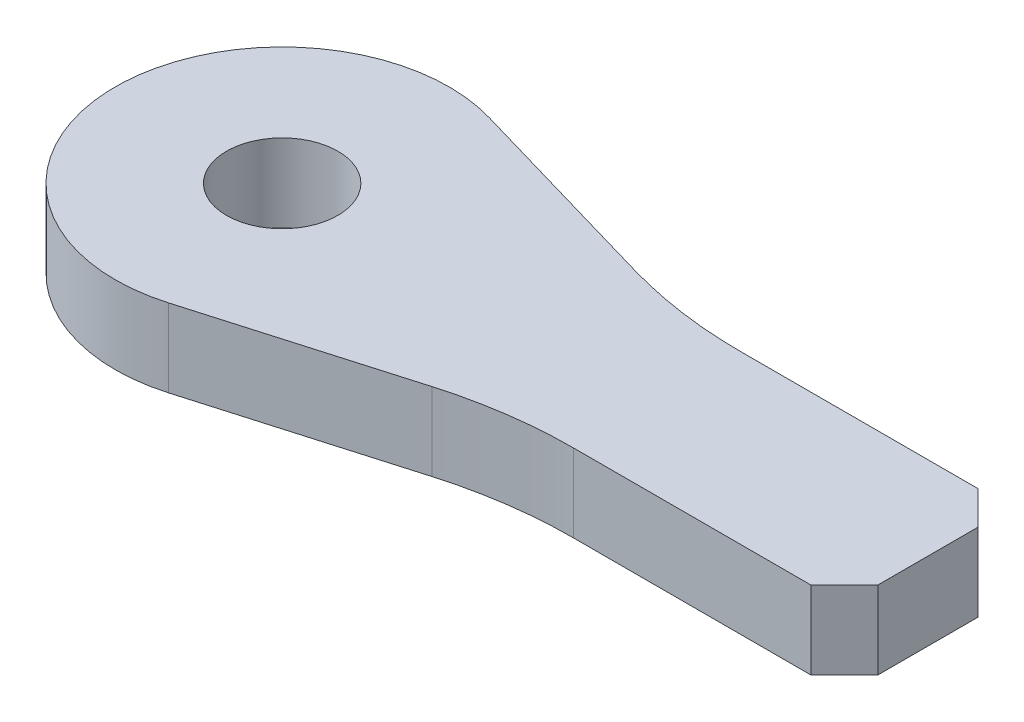
ISO-10303-21;
HEADER;
FILE_DESCRIPTION(('STEP AP214'),'2;1');
FILE_NAME('part.step','',(''),(''),'','','');
FILE_SCHEMA(('AUTOMOTIVE_DESIGN { 1 0 10303 214 1 1 1 1 }'));
ENDSEC;
DATA;
#1=APPLICATION_CONTEXT('core data for automotive mechanical design processes');
#2=APPLICATION_PROTOCOL_DEFINITION('international standard','automotive_design',2000,#1);
#3=PRODUCT_CONTEXT('',#1,'mechanical');
#4=PRODUCT('Part','Part','',(#3));
#5=PRODUCT_RELATED_PRODUCT_CATEGORY('part','',(#4));
#6=PRODUCT_DEFINITION_FORMATION('','',#4);
#7=PRODUCT_DEFINITION_CONTEXT('part definition',#1,'design');
#8=PRODUCT_DEFINITION('design','',#6,#7);
#9=PRODUCT_DEFINITION_SHAPE('','',#8);
#10=(LENGTH_UNIT() NAMED_UNIT(*) SI_UNIT(.MILLI.,.METRE.));
#11=(NAMED_UNIT(*) PLANE_ANGLE_UNIT() SI_UNIT($,.RADIAN.));
#12=(NAMED_UNIT(*) SI_UNIT($,.STERADIAN.) SOLID_ANGLE_UNIT());
#13=UNCERTAINTY_MEASURE_WITH_UNIT(LENGTH_MEASURE(1.E-05),#10,'distance_accuracy_value','');
#14=(GEOMETRIC_REPRESENTATION_CONTEXT(3) GLOBAL_UNCERTAINTY_ASSIGNED_CONTEXT((#13)) GLOBAL_UNIT_ASSIGNED_CONTEXT((#10,
#11,#12)) REPRESENTATION_CONTEXT('',''));
#15=CARTESIAN_POINT('',(0.,0.,0.));
#16=DIRECTION('',(0.,0.,1.));
#17=DIRECTION('',(1.,0.,0.));
#18=AXIS2_PLACEMENT_3D('',#15,#16,#17);
#19=CARTESIAN_POINT('',(13.1836541139506,7.,47.5));
#20=DIRECTION('',(0.,1.,0.));
#21=DIRECTION('',(0.,0.,1.));
#22=AXIS2_PLACEMENT_3D('',#19,#20,#21);
#23=PLANE('',#22);
#24=CARTESIAN_POINT('',(13.1836541139506,7.,47.5));
#25=DIRECTION('',(0.,-1.,0.));
#26=DIRECTION('',(0.,0.,1.));
#27=AXIS2_PLACEMENT_3D('',#24,#25,#26);
#28=CIRCLE('',#27,40.);
#29=CARTESIAN_POINT('',(2.0413092992037,7.,9.08323084863482));
#30=VERTEX_POINT('',#29);
#31=CARTESIAN_POINT('',(13.1836541139507,7.,7.5));
#32=VERTEX_POINT('',#31);
#33=EDGE_CURVE('E161',#30,#32,#28,.T.);
#34=ORIENTED_EDGE('',*,*,#33,.T.);
#35=DIRECTION('',(1.,0.,0.));
#36=VECTOR('',#35,1.);
#37=CARTESIAN_POINT('',(13.1836541139507,7.,7.5));
#38=LINE('',#37,#36);
#39=CARTESIAN_POINT('',(34.5,7.,7.5));
#40=VERTEX_POINT('',#39);
#41=EDGE_CURVE('E99',#32,#40,#38,.T.);
#42=ORIENTED_EDGE('',*,*,#41,.T.);
#43=DIRECTION('',(0.707106781186548,0.,-0.707106781186547));
#44=VECTOR('',#43,1.);
#45=CARTESIAN_POINT('',(34.5,7.,7.5));
#46=LINE('',#45,#44);
#47=CARTESIAN_POINT('',(37.5,7.,4.5));
#48=VERTEX_POINT('',#47);
#49=EDGE_CURVE('E182',#40,#48,#46,.T.);
#50=ORIENTED_EDGE('',*,*,#49,.T.);
#51=DIRECTION('',(0.,0.,-1.));
#52=VECTOR('',#51,1.);
#53=CARTESIAN_POINT('',(37.5,7.,4.5));
#54=LINE('',#53,#52);
#55=CARTESIAN_POINT('',(37.5,7.,-4.49999999999999));
#56=VERTEX_POINT('',#55);
#57=EDGE_CURVE('E201',#48,#56,#54,.T.);
#58=ORIENTED_EDGE('',*,*,#57,.T.);
#59=DIRECTION('',(-0.707106781186547,0.,-0.707106781186548));
#60=VECTOR('',#59,1.);
#61=CARTESIAN_POINT('',(37.5,7.,-4.49999999999999));
#62=LINE('',#61,#60);
#63=CARTESIAN_POINT('',(34.5,7.,-7.5));
#64=VERTEX_POINT('',#63);
#65=EDGE_CURVE('E198',#56,#64,#62,.T.);
#66=ORIENTED_EDGE('',*,*,#65,.T.);
#67=DIRECTION('',(-1.,0.,0.));
#68=VECTOR('',#67,1.);
#69=CARTESIAN_POINT('',(34.5,7.,-7.5));
#70=LINE('',#69,#68);
#71=CARTESIAN_POINT('',(13.1836541139507,7.,-7.5));
#72=VERTEX_POINT('',#71);
#73=EDGE_CURVE('E200',#64,#72,#70,.T.);
#74=ORIENTED_EDGE('',*,*,#73,.T.);
#75=CARTESIAN_POINT('',(13.1836541139506,7.,-47.5));
#76=DIRECTION('',(0.,-1.,0.));
#77=DIRECTION('',(0.,0.,-1.));
#78=AXIS2_PLACEMENT_3D('',#75,#76,#77);
#79=CIRCLE('',#78,40.);
#80=CARTESIAN_POINT('',(2.04130929920372,7.,-9.0832308486348));
#81=VERTEX_POINT('',#80);
#82=EDGE_CURVE('E124',#72,#81,#79,.T.);
#83=ORIENTED_EDGE('',*,*,#82,.T.);
#84=DIRECTION('',(-0.960419228784131,0.,-0.278558620368668));
#85=VECTOR('',#84,1.);
#86=CARTESIAN_POINT('',(2.0413092992037,7.,-9.08323084863481));
#87=LINE('',#86,#85);
#88=CARTESIAN_POINT('',(-16.31162069447,7.,-14.406288431762));
#89=VERTEX_POINT('',#88);
#90=EDGE_CURVE('E118',#81,#89,#87,.T.);
#91=ORIENTED_EDGE('',*,*,#90,.T.);
#92=CARTESIAN_POINT('',(-20.49,7.,0.));
#93=DIRECTION('',(0.,1.,0.));
#94=DIRECTION('',(0.,0.,1.));
#95=AXIS2_PLACEMENT_3D('',#92,#93,#94);
#96=CIRCLE('',#95,15.);
#97=CARTESIAN_POINT('',(-16.31162069447,7.,14.406288431762));
#98=VERTEX_POINT('',#97);
#99=EDGE_CURVE('E122',#89,#98,#96,.T.);
#100=ORIENTED_EDGE('',*,*,#99,.T.);
#101=DIRECTION('',(0.960419228784131,0.,-0.278558620368668));
#102=VECTOR('',#101,1.);
#103=CARTESIAN_POINT('',(2.0413092992037,7.,9.08323084863482));
#104=LINE('',#103,#102);
#105=EDGE_CURVE('E50',#98,#30,#104,.T.);
#106=ORIENTED_EDGE('',*,*,#105,.T.);
#107=EDGE_LOOP('',(#34,#42,#50,#58,#66,#74,#83,#91,#100,#106));
#108=FACE_BOUND('',#107,.T.);
#109=CARTESIAN_POINT('',(-20.49,7.,0.));
#110=DIRECTION('',(0.,1.,0.));
#111=DIRECTION('',(0.,0.,1.));
#112=AXIS2_PLACEMENT_3D('',#109,#110,#111);
#113=CIRCLE('',#112,5.);
#114=CARTESIAN_POINT('',(-20.49,7.,5.));
#115=VERTEX_POINT('',#114);
#116=EDGE_CURVE('E146',#115,#115,#113,.T.);
#117=ORIENTED_EDGE('',*,*,#116,.F.);
#118=EDGE_LOOP('',(#117));
#119=FACE_BOUND('',#118,.T.);
#120=ADVANCED_FACE('F33',(#108,#119),#23,.T.);
#121=CARTESIAN_POINT('',(13.1836541139506,0.,47.5));
#122=DIRECTION('',(0.,1.,0.));
#123=DIRECTION('',(0.,0.,1.));
#124=AXIS2_PLACEMENT_3D('',#121,#122,#123);
#125=PLANE('',#124);
#126=CARTESIAN_POINT('',(13.1836541139506,0.,47.5));
#127=DIRECTION('',(0.,-1.,0.));
#128=DIRECTION('',(0.,0.,1.));
#129=AXIS2_PLACEMENT_3D('',#126,#127,#128);
#130=CIRCLE('',#129,40.);
#131=CARTESIAN_POINT('',(2.0413092992037,0.,9.08323084863482));
#132=VERTEX_POINT('',#131);
#133=CARTESIAN_POINT('',(13.1836541139507,0.,7.5));
#134=VERTEX_POINT('',#133);
#135=EDGE_CURVE('E142',#132,#134,#130,.T.);
#136=ORIENTED_EDGE('',*,*,#135,.F.);
#137=DIRECTION('',(0.960419228784131,0.,-0.278558620368668));
#138=VECTOR('',#137,1.);
#139=CARTESIAN_POINT('',(2.0413092992037,0.,9.08323084863482));
#140=LINE('',#139,#138);
#141=CARTESIAN_POINT('',(-16.31162069447,0.,14.406288431762));
#142=VERTEX_POINT('',#141);
#143=EDGE_CURVE('E91',#142,#132,#140,.T.);
#144=ORIENTED_EDGE('',*,*,#143,.F.);
#145=CARTESIAN_POINT('',(-20.49,0.,0.));
#146=DIRECTION('',(0.,1.,0.));
#147=DIRECTION('',(0.,0.,1.));
#148=AXIS2_PLACEMENT_3D('',#145,#146,#147);
#149=CIRCLE('',#148,15.);
#150=CARTESIAN_POINT('',(-16.31162069447,0.,-14.406288431762));
#151=VERTEX_POINT('',#150);
#152=EDGE_CURVE('E85',#151,#142,#149,.T.);
#153=ORIENTED_EDGE('',*,*,#152,.F.);
#154=DIRECTION('',(-0.960419228784131,0.,-0.278558620368668));
#155=VECTOR('',#154,1.);
#156=CARTESIAN_POINT('',(2.0413092992037,0.,-9.08323084863481));
#157=LINE('',#156,#155);
#158=CARTESIAN_POINT('',(2.04130929920372,0.,-9.0832308486348));
#159=VERTEX_POINT('',#158);
#160=EDGE_CURVE('E132',#159,#151,#157,.T.);
#161=ORIENTED_EDGE('',*,*,#160,.F.);
#162=CARTESIAN_POINT('',(13.1836541139506,0.,-47.5));
#163=DIRECTION('',(0.,-1.,0.));
#164=DIRECTION('',(0.,0.,-1.));
#165=AXIS2_PLACEMENT_3D('',#162,#163,#164);
#166=CIRCLE('',#165,40.);
#167=CARTESIAN_POINT('',(13.1836541139507,0.,-7.5));
#168=VERTEX_POINT('',#167);
#169=EDGE_CURVE('E156',#168,#159,#166,.T.);
#170=ORIENTED_EDGE('',*,*,#169,.F.);
#171=DIRECTION('',(-1.,0.,0.));
#172=VECTOR('',#171,1.);
#173=CARTESIAN_POINT('',(34.5,0.,-7.5));
#174=LINE('',#173,#172);
#175=CARTESIAN_POINT('',(34.5,0.,-7.5));
#176=VERTEX_POINT('',#175);
#177=EDGE_CURVE('E154',#176,#168,#174,.T.);
#178=ORIENTED_EDGE('',*,*,#177,.F.);
#179=DIRECTION('',(-0.707106781186547,0.,-0.707106781186548));
#180=VECTOR('',#179,1.);
#181=CARTESIAN_POINT('',(37.5,0.,-4.49999999999999));
#182=LINE('',#181,#180);
#183=CARTESIAN_POINT('',(37.5,0.,-4.49999999999999));
#184=VERTEX_POINT('',#183);
#185=EDGE_CURVE('E152',#184,#176,#182,.T.);
#186=ORIENTED_EDGE('',*,*,#185,.F.);
#187=DIRECTION('',(0.,0.,-1.));
#188=VECTOR('',#187,1.);
#189=CARTESIAN_POINT('',(37.5,0.,4.5));
#190=LINE('',#189,#188);
#191=CARTESIAN_POINT('',(37.5,0.,4.5));
#192=VERTEX_POINT('',#191);
#193=EDGE_CURVE('E150',#192,#184,#190,.T.);
#194=ORIENTED_EDGE('',*,*,#193,.F.);
#195=DIRECTION('',(0.707106781186548,0.,-0.707106781186547));
#196=VECTOR('',#195,1.);
#197=CARTESIAN_POINT('',(34.5,0.,7.5));
#198=LINE('',#197,#196);
#199=CARTESIAN_POINT('',(34.5,0.,7.5));
#200=VERTEX_POINT('',#199);
#201=EDGE_CURVE('E148',#200,#192,#198,.T.);
#202=ORIENTED_EDGE('',*,*,#201,.F.);
#203=DIRECTION('',(1.,0.,0.));
#204=VECTOR('',#203,1.);
#205=CARTESIAN_POINT('',(13.1836541139507,0.,7.5));
#206=LINE('',#205,#204);
#207=EDGE_CURVE('E145',#134,#200,#206,.T.);
#208=ORIENTED_EDGE('',*,*,#207,.F.);
#209=EDGE_LOOP('',(#136,#144,#153,#161,#170,#178,#186,#194,#202,#208));
#210=FACE_BOUND('',#209,.T.);
#211=CARTESIAN_POINT('',(-20.49,0.,0.));
#212=DIRECTION('',(0.,1.,0.));
#213=DIRECTION('',(0.,0.,1.));
#214=AXIS2_PLACEMENT_3D('',#211,#212,#213);
#215=CIRCLE('',#214,5.);
#216=CARTESIAN_POINT('',(-20.49,0.,5.));
#217=VERTEX_POINT('',#216);
#218=EDGE_CURVE('E209',#217,#217,#215,.T.);
#219=ORIENTED_EDGE('',*,*,#218,.T.);
#220=EDGE_LOOP('',(#219));
#221=FACE_BOUND('',#220,.T.);
#222=ADVANCED_FACE('F186',(#210,#221),#125,.F.);
#223=CARTESIAN_POINT('',(13.1836541139506,7.,47.5));
#224=DIRECTION('',(0.,-1.,0.));
#225=DIRECTION('',(0.,0.,-1.));
#226=AXIS2_PLACEMENT_3D('',#223,#224,#225);
#227=CYLINDRICAL_SURFACE('',#226,40.);
#228=ORIENTED_EDGE('',*,*,#135,.T.);
#229=DIRECTION('',(0.,-1.,0.));
#230=VECTOR('',#229,1.);
#231=CARTESIAN_POINT('',(13.1836541139507,7.,7.5));
#232=LINE('',#231,#230);
#233=EDGE_CURVE('E11',#32,#134,#232,.T.);
#234=ORIENTED_EDGE('',*,*,#233,.F.);
#235=ORIENTED_EDGE('',*,*,#33,.F.);
#236=DIRECTION('',(0.,-1.,0.));
#237=VECTOR('',#236,1.);
#238=CARTESIAN_POINT('',(2.0413092992037,7.,9.08323084863482));
#239=LINE('',#238,#237);
#240=EDGE_CURVE('E138',#30,#132,#239,.T.);
#241=ORIENTED_EDGE('',*,*,#240,.T.);
#242=EDGE_LOOP('',(#228,#234,#235,#241));
#243=FACE_BOUND('',#242,.T.);
#244=ADVANCED_FACE('F35',(#243),#227,.F.);
#245=CARTESIAN_POINT('',(13.1836541139507,7.,7.5));
#246=DIRECTION('',(0.,0.,-1.));
#247=DIRECTION('',(-1.,0.,0.));
#248=AXIS2_PLACEMENT_3D('',#245,#246,#247);
#249=PLANE('',#248);
#250=ORIENTED_EDGE('',*,*,#207,.T.);
#251=DIRECTION('',(0.,-1.,0.));
#252=VECTOR('',#251,1.);
#253=CARTESIAN_POINT('',(34.5,7.,7.5));
#254=LINE('',#253,#252);
#255=EDGE_CURVE('E42',#40,#200,#254,.T.);
#256=ORIENTED_EDGE('',*,*,#255,.F.);
#257=ORIENTED_EDGE('',*,*,#41,.F.);
#258=ORIENTED_EDGE('',*,*,#233,.T.);
#259=EDGE_LOOP('',(#250,#256,#257,#258));
#260=FACE_BOUND('',#259,.T.);
#261=ADVANCED_FACE('F245',(#260),#249,.F.);
#262=CARTESIAN_POINT('',(34.5,7.,7.5));
#263=DIRECTION('',(-0.707106781186547,0.,-0.707106781186548));
#264=DIRECTION('',(-0.707106781186548,0.,0.707106781186547));
#265=AXIS2_PLACEMENT_3D('',#262,#263,#264);
#266=PLANE('',#265);
#267=ORIENTED_EDGE('',*,*,#201,.T.);
#268=DIRECTION('',(0.,-1.,0.));
#269=VECTOR('',#268,1.);
#270=CARTESIAN_POINT('',(37.5,7.,4.5));
#271=LINE('',#270,#269);
#272=EDGE_CURVE('E174',#48,#192,#271,.T.);
#273=ORIENTED_EDGE('',*,*,#272,.F.);
#274=ORIENTED_EDGE('',*,*,#49,.F.);
#275=ORIENTED_EDGE('',*,*,#255,.T.);
#276=EDGE_LOOP('',(#267,#273,#274,#275));
#277=FACE_BOUND('',#276,.T.);
#278=ADVANCED_FACE('F180',(#277),#266,.F.);
#279=CARTESIAN_POINT('',(37.5,7.,4.5));
#280=DIRECTION('',(-1.,0.,0.));
#281=DIRECTION('',(0.,0.,1.));
#282=AXIS2_PLACEMENT_3D('',#279,#280,#281);
#283=PLANE('',#282);
#284=ORIENTED_EDGE('',*,*,#193,.T.);
#285=DIRECTION('',(0.,-1.,0.));
#286=VECTOR('',#285,1.);
#287=CARTESIAN_POINT('',(37.5,7.,-4.49999999999999));
#288=LINE('',#287,#286);
#289=EDGE_CURVE('E171',#56,#184,#288,.T.);
#290=ORIENTED_EDGE('',*,*,#289,.F.);
#291=ORIENTED_EDGE('',*,*,#57,.F.);
#292=ORIENTED_EDGE('',*,*,#272,.T.);
#293=EDGE_LOOP('',(#284,#290,#291,#292));
#294=FACE_BOUND('',#293,.T.);
#295=ADVANCED_FACE('F192',(#294),#283,.F.);
#296=CARTESIAN_POINT('',(37.5,7.,-4.49999999999999));
#297=DIRECTION('',(-0.707106781186548,0.,0.707106781186547));
#298=DIRECTION('',(0.707106781186547,0.,0.707106781186548));
#299=AXIS2_PLACEMENT_3D('',#296,#297,#298);
#300=PLANE('',#299);
#301=ORIENTED_EDGE('',*,*,#185,.T.);
#302=DIRECTION('',(0.,-1.,0.));
#303=VECTOR('',#302,1.);
#304=CARTESIAN_POINT('',(34.5,7.,-7.5));
#305=LINE('',#304,#303);
#306=EDGE_CURVE('E168',#64,#176,#305,.T.);
#307=ORIENTED_EDGE('',*,*,#306,.F.);
#308=ORIENTED_EDGE('',*,*,#65,.F.);
#309=ORIENTED_EDGE('',*,*,#289,.T.);
#310=EDGE_LOOP('',(#301,#307,#308,#309));
#311=FACE_BOUND('',#310,.T.);
#312=ADVANCED_FACE('F196',(#311),#300,.F.);
#313=CARTESIAN_POINT('',(34.5,7.,-7.5));
#314=DIRECTION('',(0.,0.,1.));
#315=DIRECTION('',(1.,0.,0.));
#316=AXIS2_PLACEMENT_3D('',#313,#314,#315);
#317=PLANE('',#316);
#318=ORIENTED_EDGE('',*,*,#177,.T.);
#319=DIRECTION('',(0.,-1.,0.));
#320=VECTOR('',#319,1.);
#321=CARTESIAN_POINT('',(13.1836541139507,7.,-7.5));
#322=LINE('',#321,#320);
#323=EDGE_CURVE('E165',#72,#168,#322,.T.);
#324=ORIENTED_EDGE('',*,*,#323,.F.);
#325=ORIENTED_EDGE('',*,*,#73,.F.);
#326=ORIENTED_EDGE('',*,*,#306,.T.);
#327=EDGE_LOOP('',(#318,#324,#325,#326));
#328=FACE_BOUND('',#327,.T.);
#329=ADVANCED_FACE('F235',(#328),#317,.F.);
#330=CARTESIAN_POINT('',(13.1836541139506,7.,-47.5));
#331=DIRECTION('',(0.,-1.,0.));
#332=DIRECTION('',(0.,0.,-1.));
#333=AXIS2_PLACEMENT_3D('',#330,#331,#332);
#334=CYLINDRICAL_SURFACE('',#333,40.);
#335=ORIENTED_EDGE('',*,*,#169,.T.);
#336=DIRECTION('',(0.,-1.,0.));
#337=VECTOR('',#336,1.);
#338=CARTESIAN_POINT('',(2.04130929920372,7.,-9.0832308486348));
#339=LINE('',#338,#337);
#340=EDGE_CURVE('E133',#81,#159,#339,.T.);
#341=ORIENTED_EDGE('',*,*,#340,.F.);
#342=ORIENTED_EDGE('',*,*,#82,.F.);
#343=ORIENTED_EDGE('',*,*,#323,.T.);
#344=EDGE_LOOP('',(#335,#341,#342,#343));
#345=FACE_BOUND('',#344,.T.);
#346=ADVANCED_FACE('F232',(#345),#334,.F.);
#347=CARTESIAN_POINT('',(2.0413092992037,7.,-9.08323084863481));
#348=DIRECTION('',(-0.278558620368668,0.,0.960419228784131));
#349=DIRECTION('',(0.960419228784131,0.,0.278558620368668));
#350=AXIS2_PLACEMENT_3D('',#347,#348,#349);
#351=PLANE('',#350);
#352=ORIENTED_EDGE('',*,*,#160,.T.);
#353=DIRECTION('',(0.,-1.,0.));
#354=VECTOR('',#353,1.);
#355=CARTESIAN_POINT('',(-16.31162069447,7.,-14.406288431762));
#356=LINE('',#355,#354);
#357=EDGE_CURVE('E129',#89,#151,#356,.T.);
#358=ORIENTED_EDGE('',*,*,#357,.F.);
#359=ORIENTED_EDGE('',*,*,#90,.F.);
#360=ORIENTED_EDGE('',*,*,#340,.T.);
#361=EDGE_LOOP('',(#352,#358,#359,#360));
#362=FACE_BOUND('',#361,.T.);
#363=ADVANCED_FACE('F130',(#362),#351,.F.);
#364=CARTESIAN_POINT('',(-20.49,7.,0.));
#365=DIRECTION('',(0.,-1.,0.));
#366=DIRECTION('',(0.,0.,-1.));
#367=AXIS2_PLACEMENT_3D('',#364,#365,#366);
#368=CYLINDRICAL_SURFACE('',#367,15.);
#369=ORIENTED_EDGE('',*,*,#152,.T.);
#370=DIRECTION('',(0.,-1.,0.));
#371=VECTOR('',#370,1.);
#372=CARTESIAN_POINT('',(-16.31162069447,7.,14.406288431762));
#373=LINE('',#372,#371);
#374=EDGE_CURVE('E134',#98,#142,#373,.T.);
#375=ORIENTED_EDGE('',*,*,#374,.F.);
#376=ORIENTED_EDGE('',*,*,#99,.F.);
#377=ORIENTED_EDGE('',*,*,#357,.T.);
#378=EDGE_LOOP('',(#369,#375,#376,#377));
#379=FACE_BOUND('',#378,.T.);
#380=ADVANCED_FACE('F136',(#379),#368,.T.);
#381=CARTESIAN_POINT('',(2.0413092992037,7.,9.08323084863482));
#382=DIRECTION('',(-0.278558620368668,0.,-0.960419228784131));
#383=DIRECTION('',(-0.960419228784131,0.,0.278558620368668));
#384=AXIS2_PLACEMENT_3D('',#381,#382,#383);
#385=PLANE('',#384);
#386=ORIENTED_EDGE('',*,*,#143,.T.);
#387=ORIENTED_EDGE('',*,*,#240,.F.);
#388=ORIENTED_EDGE('',*,*,#105,.F.);
#389=ORIENTED_EDGE('',*,*,#374,.T.);
#390=EDGE_LOOP('',(#386,#387,#388,#389));
#391=FACE_BOUND('',#390,.T.);
#392=ADVANCED_FACE('F225',(#391),#385,.F.);
#393=CARTESIAN_POINT('',(-20.49,7.,0.));
#394=DIRECTION('',(0.,-1.,0.));
#395=DIRECTION('',(0.,0.,-1.));
#396=AXIS2_PLACEMENT_3D('',#393,#394,#395);
#397=CYLINDRICAL_SURFACE('',#396,5.);
#398=ORIENTED_EDGE('',*,*,#116,.T.);
#399=EDGE_LOOP('',(#398));
#400=FACE_BOUND('',#399,.T.);
#401=ORIENTED_EDGE('',*,*,#218,.F.);
#402=EDGE_LOOP('',(#401));
#403=FACE_BOUND('',#402,.T.);
#404=ADVANCED_FACE('F215',(#400,#403),#397,.F.);
#405=CLOSED_SHELL('',(#120,#222,#244,#261,#278,#295,#312,#329,#346,#363,#380,#392,#404));
#406=MANIFOLD_SOLID_BREP('B2',#405);
#407=ADVANCED_BREP_SHAPE_REPRESENTATION('',(#18,#406),#14);
#408=SHAPE_DEFINITION_REPRESENTATION(#9,#407);
ENDSEC;
END-ISO-10303-21;
